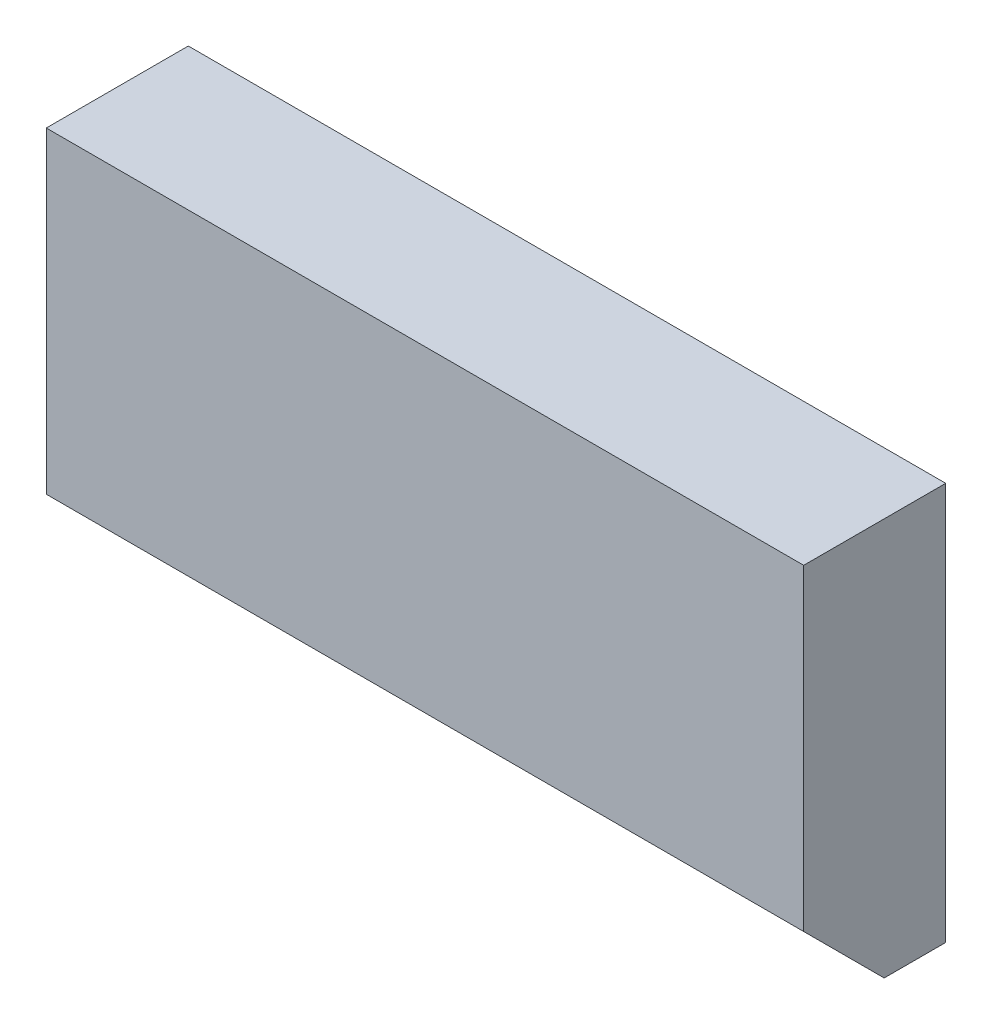
ISO-10303-21;
HEADER;
FILE_DESCRIPTION(('STEP AP214'),'2;1');
FILE_NAME('part.step','',(''),(''),'','','');
FILE_SCHEMA(('AUTOMOTIVE_DESIGN { 1 0 10303 214 1 1 1 1 }'));
ENDSEC;
DATA;
#1=APPLICATION_CONTEXT('core data for automotive mechanical design processes');
#2=APPLICATION_PROTOCOL_DEFINITION('international standard','automotive_design',2000,#1);
#3=PRODUCT_CONTEXT('',#1,'mechanical');
#4=PRODUCT('Part','Part','',(#3));
#5=PRODUCT_RELATED_PRODUCT_CATEGORY('part','',(#4));
#6=PRODUCT_DEFINITION_FORMATION('','',#4);
#7=PRODUCT_DEFINITION_CONTEXT('part definition',#1,'design');
#8=PRODUCT_DEFINITION('design','',#6,#7);
#9=PRODUCT_DEFINITION_SHAPE('','',#8);
#10=(LENGTH_UNIT() NAMED_UNIT(*) SI_UNIT(.MILLI.,.METRE.));
#11=(NAMED_UNIT(*) PLANE_ANGLE_UNIT() SI_UNIT($,.RADIAN.));
#12=(NAMED_UNIT(*) SI_UNIT($,.STERADIAN.) SOLID_ANGLE_UNIT());
#13=UNCERTAINTY_MEASURE_WITH_UNIT(LENGTH_MEASURE(1.E-05),#10,'distance_accuracy_value','');
#14=(GEOMETRIC_REPRESENTATION_CONTEXT(3) GLOBAL_UNCERTAINTY_ASSIGNED_CONTEXT((#13)) GLOBAL_UNIT_ASSIGNED_CONTEXT((#10,
#11,#12)) REPRESENTATION_CONTEXT('',''));
#15=CARTESIAN_POINT('',(0.,0.,0.));
#16=DIRECTION('',(0.,0.,1.));
#17=DIRECTION('',(1.,0.,0.));
#18=AXIS2_PLACEMENT_3D('',#15,#16,#17);
#19=CARTESIAN_POINT('',(16.,0.,3.));
#20=DIRECTION('',(-1.,0.,0.));
#21=DIRECTION('',(0.,0.,1.));
#22=AXIS2_PLACEMENT_3D('',#19,#20,#21);
#23=PLANE('',#22);
#24=DIRECTION('',(0.,-0.707106781186547,-0.707106781186549));
#25=VECTOR('',#24,1.);
#26=CARTESIAN_POINT('',(16.,2.,3.));
#27=LINE('',#26,#25);
#28=CARTESIAN_POINT('',(16.,2.,3.));
#29=VERTEX_POINT('',#28);
#30=CARTESIAN_POINT('',(16.,0.3,1.29999999999999));
#31=VERTEX_POINT('',#30);
#32=EDGE_CURVE('E110',#29,#31,#27,.T.);
#33=ORIENTED_EDGE('',*,*,#32,.T.);
#34=DIRECTION('',(0.,0.,-1.));
#35=VECTOR('',#34,1.);
#36=CARTESIAN_POINT('',(16.,0.299999999999999,3.));
#37=LINE('',#36,#35);
#38=CARTESIAN_POINT('',(16.,0.299999999999999,0.));
#39=VERTEX_POINT('',#38);
#40=EDGE_CURVE('E121',#31,#39,#37,.T.);
#41=ORIENTED_EDGE('',*,*,#40,.T.);
#42=DIRECTION('',(0.,1.,0.));
#43=VECTOR('',#42,1.);
#44=CARTESIAN_POINT('',(16.,0.,0.));
#45=LINE('',#44,#43);
#46=CARTESIAN_POINT('',(16.,8.7,0.));
#47=VERTEX_POINT('',#46);
#48=EDGE_CURVE('E107',#39,#47,#45,.T.);
#49=ORIENTED_EDGE('',*,*,#48,.T.);
#50=DIRECTION('',(0.,0.,-1.));
#51=VECTOR('',#50,1.);
#52=CARTESIAN_POINT('',(16.,8.7,3.));
#53=LINE('',#52,#51);
#54=CARTESIAN_POINT('',(16.,8.7,3.));
#55=VERTEX_POINT('',#54);
#56=EDGE_CURVE('E100',#55,#47,#53,.T.);
#57=ORIENTED_EDGE('',*,*,#56,.F.);
#58=DIRECTION('',(0.,1.,0.));
#59=VECTOR('',#58,1.);
#60=CARTESIAN_POINT('',(16.,0.,3.));
#61=LINE('',#60,#59);
#62=EDGE_CURVE('E84',#29,#55,#61,.T.);
#63=ORIENTED_EDGE('',*,*,#62,.F.);
#64=EDGE_LOOP('',(#33,#41,#49,#57,#63));
#65=FACE_BOUND('',#64,.T.);
#66=ADVANCED_FACE('F32',(#65),#23,.F.);
#67=CARTESIAN_POINT('',(16.,8.7,3.));
#68=DIRECTION('',(0.,-1.,0.));
#69=DIRECTION('',(1.,0.,0.));
#70=AXIS2_PLACEMENT_3D('',#67,#68,#69);
#71=PLANE('',#70);
#72=DIRECTION('',(-1.,0.,0.));
#73=VECTOR('',#72,1.);
#74=CARTESIAN_POINT('',(16.,8.7,0.));
#75=LINE('',#74,#73);
#76=CARTESIAN_POINT('',(0.,8.7,0.));
#77=VERTEX_POINT('',#76);
#78=EDGE_CURVE('E128',#47,#77,#75,.T.);
#79=ORIENTED_EDGE('',*,*,#78,.T.);
#80=DIRECTION('',(0.,0.,-1.));
#81=VECTOR('',#80,1.);
#82=CARTESIAN_POINT('',(0.,8.7,3.));
#83=LINE('',#82,#81);
#84=CARTESIAN_POINT('',(0.,8.7,3.));
#85=VERTEX_POINT('',#84);
#86=EDGE_CURVE('E102',#85,#77,#83,.T.);
#87=ORIENTED_EDGE('',*,*,#86,.F.);
#88=DIRECTION('',(-1.,0.,0.));
#89=VECTOR('',#88,1.);
#90=CARTESIAN_POINT('',(16.,8.7,3.));
#91=LINE('',#90,#89);
#92=EDGE_CURVE('E88',#55,#85,#91,.T.);
#93=ORIENTED_EDGE('',*,*,#92,.F.);
#94=ORIENTED_EDGE('',*,*,#56,.T.);
#95=EDGE_LOOP('',(#79,#87,#93,#94));
#96=FACE_BOUND('',#95,.T.);
#97=ADVANCED_FACE('F99',(#96),#71,.F.);
#98=CARTESIAN_POINT('',(0.,0.,3.));
#99=DIRECTION('',(1.,0.,0.));
#100=DIRECTION('',(0.,0.,-1.));
#101=AXIS2_PLACEMENT_3D('',#98,#99,#100);
#102=PLANE('',#101);
#103=DIRECTION('',(0.,0.,-1.));
#104=VECTOR('',#103,1.);
#105=CARTESIAN_POINT('',(0.,0.,3.));
#106=LINE('',#105,#104);
#107=CARTESIAN_POINT('',(0.,0.,0.999999999999992));
#108=VERTEX_POINT('',#107);
#109=CARTESIAN_POINT('',(0.,0.,0.));
#110=VERTEX_POINT('',#109);
#111=EDGE_CURVE('E112',#108,#110,#106,.T.);
#112=ORIENTED_EDGE('',*,*,#111,.F.);
#113=DIRECTION('',(0.,0.707106781186547,0.707106781186549));
#114=VECTOR('',#113,1.);
#115=CARTESIAN_POINT('',(0.,2.,3.));
#116=LINE('',#115,#114);
#117=CARTESIAN_POINT('',(0.,2.,3.));
#118=VERTEX_POINT('',#117);
#119=EDGE_CURVE('E119',#108,#118,#116,.T.);
#120=ORIENTED_EDGE('',*,*,#119,.T.);
#121=DIRECTION('',(0.,-1.,0.));
#122=VECTOR('',#121,1.);
#123=CARTESIAN_POINT('',(0.,0.,3.));
#124=LINE('',#123,#122);
#125=EDGE_CURVE('E104',#85,#118,#124,.T.);
#126=ORIENTED_EDGE('',*,*,#125,.F.);
#127=ORIENTED_EDGE('',*,*,#86,.T.);
#128=DIRECTION('',(0.,-1.,0.));
#129=VECTOR('',#128,1.);
#130=CARTESIAN_POINT('',(0.,0.,0.));
#131=LINE('',#130,#129);
#132=EDGE_CURVE('E130',#77,#110,#131,.T.);
#133=ORIENTED_EDGE('',*,*,#132,.T.);
#134=EDGE_LOOP('',(#112,#120,#126,#127,#133));
#135=FACE_BOUND('',#134,.T.);
#136=ADVANCED_FACE('F150',(#135),#102,.F.);
#137=CARTESIAN_POINT('',(16.,0.,3.));
#138=DIRECTION('',(0.,1.,0.));
#139=DIRECTION('',(-1.,0.,0.));
#140=AXIS2_PLACEMENT_3D('',#137,#138,#139);
#141=PLANE('',#140);
#142=DIRECTION('',(1.,0.,0.));
#143=VECTOR('',#142,1.);
#144=CARTESIAN_POINT('',(16.,0.,0.));
#145=LINE('',#144,#143);
#146=CARTESIAN_POINT('',(15.7,0.,0.));
#147=VERTEX_POINT('',#146);
#148=EDGE_CURVE('E95',#110,#147,#145,.T.);
#149=ORIENTED_EDGE('',*,*,#148,.T.);
#150=DIRECTION('',(0.,0.,1.));
#151=VECTOR('',#150,1.);
#152=CARTESIAN_POINT('',(15.7,0.,3.));
#153=LINE('',#152,#151);
#154=CARTESIAN_POINT('',(15.7,0.,0.999999999999992));
#155=VERTEX_POINT('',#154);
#156=EDGE_CURVE('E40',#147,#155,#153,.T.);
#157=ORIENTED_EDGE('',*,*,#156,.T.);
#158=DIRECTION('',(-1.,0.,0.));
#159=VECTOR('',#158,1.);
#160=CARTESIAN_POINT('',(0.,0.,0.999999999999993));
#161=LINE('',#160,#159);
#162=EDGE_CURVE('E117',#155,#108,#161,.T.);
#163=ORIENTED_EDGE('',*,*,#162,.T.);
#164=ORIENTED_EDGE('',*,*,#111,.T.);
#165=EDGE_LOOP('',(#149,#157,#163,#164));
#166=FACE_BOUND('',#165,.T.);
#167=ADVANCED_FACE('F155',(#166),#141,.F.);
#168=CARTESIAN_POINT('',(16.,0.,3.));
#169=DIRECTION('',(0.,0.,1.));
#170=DIRECTION('',(1.,0.,0.));
#171=AXIS2_PLACEMENT_3D('',#168,#169,#170);
#172=PLANE('',#171);
#173=ORIENTED_EDGE('',*,*,#125,.T.);
#174=DIRECTION('',(1.,0.,0.));
#175=VECTOR('',#174,1.);
#176=CARTESIAN_POINT('',(16.,2.,3.));
#177=LINE('',#176,#175);
#178=EDGE_CURVE('E91',#118,#29,#177,.T.);
#179=ORIENTED_EDGE('',*,*,#178,.T.);
#180=ORIENTED_EDGE('',*,*,#62,.T.);
#181=ORIENTED_EDGE('',*,*,#92,.T.);
#182=EDGE_LOOP('',(#173,#179,#180,#181));
#183=FACE_BOUND('',#182,.T.);
#184=ADVANCED_FACE('F87',(#183),#172,.T.);
#185=CARTESIAN_POINT('',(16.,0.,0.));
#186=DIRECTION('',(0.,0.,1.));
#187=DIRECTION('',(1.,0.,0.));
#188=AXIS2_PLACEMENT_3D('',#185,#186,#187);
#189=PLANE('',#188);
#190=ORIENTED_EDGE('',*,*,#48,.F.);
#191=DIRECTION('',(0.707106781186545,0.70710678118655,0.));
#192=VECTOR('',#191,1.);
#193=CARTESIAN_POINT('',(16.,0.299999999999999,0.));
#194=LINE('',#193,#192);
#195=EDGE_CURVE('E54',#39,#147,#194,.F.);
#196=ORIENTED_EDGE('',*,*,#195,.T.);
#197=ORIENTED_EDGE('',*,*,#148,.F.);
#198=ORIENTED_EDGE('',*,*,#132,.F.);
#199=ORIENTED_EDGE('',*,*,#78,.F.);
#200=EDGE_LOOP('',(#190,#196,#197,#198,#199));
#201=FACE_BOUND('',#200,.T.);
#202=ADVANCED_FACE('F126',(#201),#189,.F.);
#203=CARTESIAN_POINT('',(16.,2.,3.));
#204=DIRECTION('',(0.,-0.707106781186549,0.707106781186547));
#205=DIRECTION('',(0.,-0.707106781186547,-0.707106781186549));
#206=AXIS2_PLACEMENT_3D('',#203,#204,#205);
#207=PLANE('',#206);
#208=ORIENTED_EDGE('',*,*,#162,.F.);
#209=DIRECTION('',(-0.577350269189623,-0.577350269189626,-0.577350269189628));
#210=VECTOR('',#209,1.);
#211=CARTESIAN_POINT('',(17.1333333333333,1.43333333333334,2.43333333333334));
#212=LINE('',#211,#210);
#213=EDGE_CURVE('E11',#155,#31,#212,.F.);
#214=ORIENTED_EDGE('',*,*,#213,.T.);
#215=ORIENTED_EDGE('',*,*,#32,.F.);
#216=ORIENTED_EDGE('',*,*,#178,.F.);
#217=ORIENTED_EDGE('',*,*,#119,.F.);
#218=EDGE_LOOP('',(#208,#214,#215,#216,#217));
#219=FACE_BOUND('',#218,.T.);
#220=ADVANCED_FACE('F140',(#219),#207,.T.);
#221=CARTESIAN_POINT('',(16.,0.299999999999999,3.));
#222=DIRECTION('',(-0.70710678118655,0.707106781186545,0.));
#223=DIRECTION('',(-0.707106781186545,-0.70710678118655,0.));
#224=AXIS2_PLACEMENT_3D('',#221,#222,#223);
#225=PLANE('',#224);
#226=ORIENTED_EDGE('',*,*,#213,.F.);
#227=ORIENTED_EDGE('',*,*,#156,.F.);
#228=ORIENTED_EDGE('',*,*,#195,.F.);
#229=ORIENTED_EDGE('',*,*,#40,.F.);
#230=EDGE_LOOP('',(#226,#227,#228,#229));
#231=FACE_BOUND('',#230,.T.);
#232=ADVANCED_FACE('F34',(#231),#225,.F.);
#233=CLOSED_SHELL('',(#66,#97,#136,#167,#184,#202,#220,#232));
#234=MANIFOLD_SOLID_BREP('B2',#233);
#235=ADVANCED_BREP_SHAPE_REPRESENTATION('',(#18,#234),#14);
#236=SHAPE_DEFINITION_REPRESENTATION(#9,#235);
ENDSEC;
END-ISO-10303-21;
